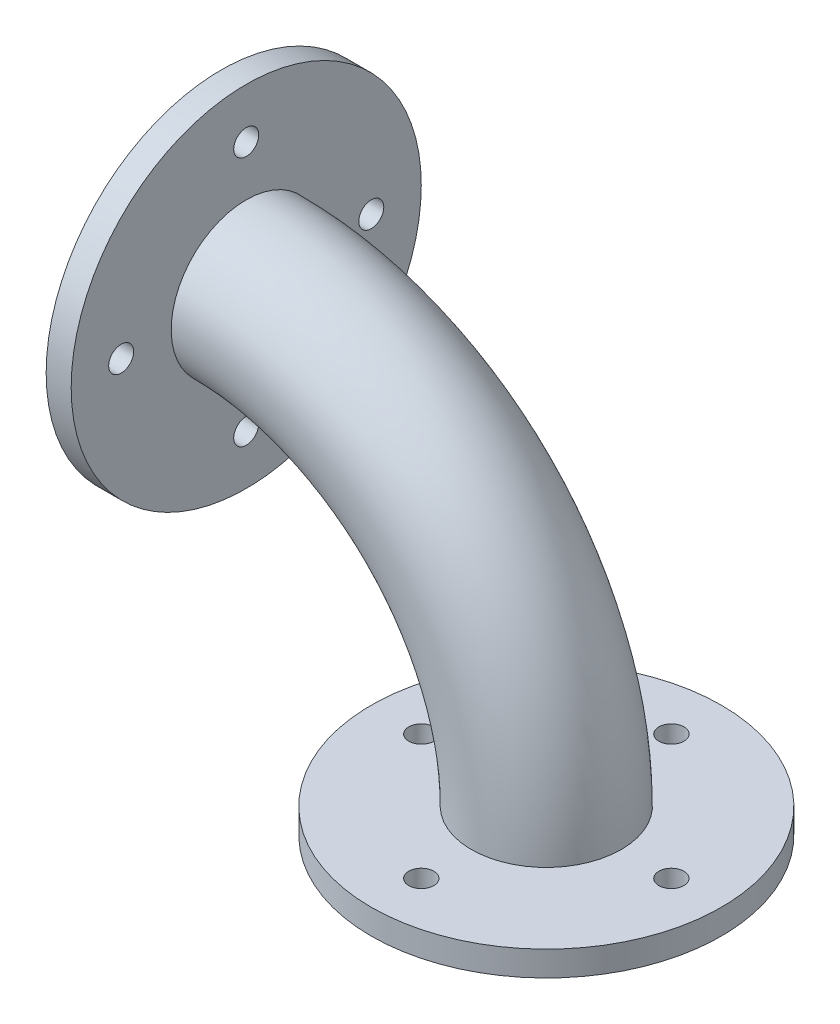
ISO-10303-21;
HEADER;
FILE_DESCRIPTION(('STEP AP214'),'2;1');
FILE_NAME('part.step','',(''),(''),'','','');
FILE_SCHEMA(('AUTOMOTIVE_DESIGN { 1 0 10303 214 1 1 1 1 }'));
ENDSEC;
DATA;
#1=APPLICATION_CONTEXT('core data for automotive mechanical design processes');
#2=APPLICATION_PROTOCOL_DEFINITION('international standard','automotive_design',2000,#1);
#3=PRODUCT_CONTEXT('',#1,'mechanical');
#4=PRODUCT('Part','Part','',(#3));
#5=PRODUCT_RELATED_PRODUCT_CATEGORY('part','',(#4));
#6=PRODUCT_DEFINITION_FORMATION('','',#4);
#7=PRODUCT_DEFINITION_CONTEXT('part definition',#1,'design');
#8=PRODUCT_DEFINITION('design','',#6,#7);
#9=PRODUCT_DEFINITION_SHAPE('','',#8);
#10=(LENGTH_UNIT() NAMED_UNIT(*) SI_UNIT(.MILLI.,.METRE.));
#11=(NAMED_UNIT(*) PLANE_ANGLE_UNIT() SI_UNIT($,.RADIAN.));
#12=(NAMED_UNIT(*) SI_UNIT($,.STERADIAN.) SOLID_ANGLE_UNIT());
#13=UNCERTAINTY_MEASURE_WITH_UNIT(LENGTH_MEASURE(1.E-05),#10,'distance_accuracy_value','');
#14=(GEOMETRIC_REPRESENTATION_CONTEXT(3) GLOBAL_UNCERTAINTY_ASSIGNED_CONTEXT((#13)) GLOBAL_UNIT_ASSIGNED_CONTEXT((#10,
#11,#12)) REPRESENTATION_CONTEXT('',''));
#15=CARTESIAN_POINT('',(0.,0.,0.));
#16=DIRECTION('',(0.,0.,1.));
#17=DIRECTION('',(1.,0.,0.));
#18=AXIS2_PLACEMENT_3D('',#15,#16,#17);
#19=CARTESIAN_POINT('',(0.,0.,0.));
#20=DIRECTION('',(0.,0.,1.));
#21=DIRECTION('',(1.,0.,0.));
#22=AXIS2_PLACEMENT_3D('',#19,#20,#21);
#23=TOROIDAL_SURFACE('',#22,76.2,19.05);
#24=CARTESIAN_POINT('',(76.2,0.,0.));
#25=DIRECTION('',(0.,-1.,0.));
#26=DIRECTION('',(0.,0.,-1.));
#27=AXIS2_PLACEMENT_3D('',#24,#25,#26);
#28=CIRCLE('',#27,19.05);
#29=CARTESIAN_POINT('',(95.25,0.,0.));
#30=VERTEX_POINT('',#29);
#31=EDGE_CURVE('E11',#30,#30,#28,.F.);
#32=CARTESIAN_POINT('',(-2.53796983429311E-13,76.2,0.));
#33=DIRECTION('',(-1.,0.,0.));
#34=DIRECTION('',(0.,-1.,0.));
#35=AXIS2_PLACEMENT_3D('',#32,#33,#34);
#36=CIRCLE('',#35,19.05);
#37=CARTESIAN_POINT('',(-3.17246229286638E-13,95.25,0.));
#38=VERTEX_POINT('',#37);
#39=EDGE_CURVE('E122',#38,#38,#36,.F.);
#40=CARTESIAN_POINT('',(0.,0.,0.));
#41=DIRECTION('',(0.,0.,1.));
#42=DIRECTION('',(1.,0.,0.));
#43=AXIS2_PLACEMENT_3D('',#40,#41,#42);
#44=CIRCLE('',#43,95.25);
#45=EDGE_CURVE('',#30,#38,#44,.T.);
#46=ORIENTED_EDGE('',*,*,#31,.T.);
#47=ORIENTED_EDGE('',*,*,#39,.T.);
#48=ORIENTED_EDGE('',*,*,#45,.T.);
#49=ORIENTED_EDGE('',*,*,#45,.F.);
#50=EDGE_LOOP('',(#46,#48,#47,#49));
#51=FACE_BOUND('',#50,.T.);
#52=ADVANCED_FACE('F80',(#51),#23,.T.);
#53=CARTESIAN_POINT('',(76.2,0.,0.));
#54=DIRECTION('',(0.,-1.,0.));
#55=DIRECTION('',(0.,0.,-1.));
#56=AXIS2_PLACEMENT_3D('',#53,#54,#55);
#57=PLANE('',#56);
#58=CARTESIAN_POINT('',(76.2,0.,31.75));
#59=DIRECTION('',(0.,-1.,0.));
#60=DIRECTION('',(0.,0.,-1.));
#61=AXIS2_PLACEMENT_3D('',#58,#59,#60);
#62=CIRCLE('',#61,3.175);
#63=CARTESIAN_POINT('',(76.2,0.,28.575));
#64=VERTEX_POINT('',#63);
#65=EDGE_CURVE('E119',#64,#64,#62,.T.);
#66=ORIENTED_EDGE('',*,*,#65,.T.);
#67=EDGE_LOOP('',(#66));
#68=FACE_BOUND('',#67,.T.);
#69=CARTESIAN_POINT('',(107.95,0.,0.));
#70=DIRECTION('',(0.,-1.,0.));
#71=DIRECTION('',(0.,0.,-1.));
#72=AXIS2_PLACEMENT_3D('',#69,#70,#71);
#73=CIRCLE('',#72,3.175);
#74=CARTESIAN_POINT('',(107.95,0.,-3.175));
#75=VERTEX_POINT('',#74);
#76=EDGE_CURVE('E113',#75,#75,#73,.T.);
#77=ORIENTED_EDGE('',*,*,#76,.T.);
#78=EDGE_LOOP('',(#77));
#79=FACE_BOUND('',#78,.T.);
#80=CARTESIAN_POINT('',(76.2,0.,-31.75));
#81=DIRECTION('',(0.,-1.,0.));
#82=DIRECTION('',(0.,0.,-1.));
#83=AXIS2_PLACEMENT_3D('',#80,#81,#82);
#84=CIRCLE('',#83,3.175);
#85=CARTESIAN_POINT('',(76.2,0.,-34.925));
#86=VERTEX_POINT('',#85);
#87=EDGE_CURVE('E107',#86,#86,#84,.T.);
#88=ORIENTED_EDGE('',*,*,#87,.T.);
#89=EDGE_LOOP('',(#88));
#90=FACE_BOUND('',#89,.T.);
#91=CARTESIAN_POINT('',(44.45,0.,0.));
#92=DIRECTION('',(0.,-1.,0.));
#93=DIRECTION('',(0.,0.,-1.));
#94=AXIS2_PLACEMENT_3D('',#91,#92,#93);
#95=CIRCLE('',#94,3.175);
#96=CARTESIAN_POINT('',(44.45,0.,-3.175));
#97=VERTEX_POINT('',#96);
#98=EDGE_CURVE('E101',#97,#97,#95,.T.);
#99=ORIENTED_EDGE('',*,*,#98,.T.);
#100=EDGE_LOOP('',(#99));
#101=FACE_BOUND('',#100,.T.);
#102=CARTESIAN_POINT('',(76.2,0.,0.));
#103=DIRECTION('',(0.,-1.,0.));
#104=DIRECTION('',(0.,0.,-1.));
#105=AXIS2_PLACEMENT_3D('',#102,#103,#104);
#106=CIRCLE('',#105,44.45);
#107=CARTESIAN_POINT('',(76.2,0.,-44.45));
#108=VERTEX_POINT('',#107);
#109=EDGE_CURVE('E95',#108,#108,#106,.T.);
#110=ORIENTED_EDGE('',*,*,#109,.F.);
#111=EDGE_LOOP('',(#110));
#112=FACE_BOUND('',#111,.T.);
#113=ORIENTED_EDGE('',*,*,#31,.F.);
#114=EDGE_LOOP('',(#113));
#115=FACE_BOUND('',#114,.T.);
#116=ADVANCED_FACE('F179',(#68,#79,#90,#101,#112,#115),#57,.F.);
#117=CARTESIAN_POINT('',(76.2,-6.35,0.));
#118=DIRECTION('',(0.,-1.,0.));
#119=DIRECTION('',(0.,0.,-1.));
#120=AXIS2_PLACEMENT_3D('',#117,#118,#119);
#121=PLANE('',#120);
#122=CARTESIAN_POINT('',(107.95,-6.35,0.));
#123=DIRECTION('',(0.,-1.,0.));
#124=DIRECTION('',(0.,0.,-1.));
#125=AXIS2_PLACEMENT_3D('',#122,#123,#124);
#126=CIRCLE('',#125,3.175);
#127=CARTESIAN_POINT('',(107.95,-6.35,-3.175));
#128=VERTEX_POINT('',#127);
#129=EDGE_CURVE('E110',#128,#128,#126,.T.);
#130=ORIENTED_EDGE('',*,*,#129,.F.);
#131=EDGE_LOOP('',(#130));
#132=FACE_BOUND('',#131,.T.);
#133=CARTESIAN_POINT('',(44.45,-6.35,0.));
#134=DIRECTION('',(0.,-1.,0.));
#135=DIRECTION('',(0.,0.,-1.));
#136=AXIS2_PLACEMENT_3D('',#133,#134,#135);
#137=CIRCLE('',#136,3.175);
#138=CARTESIAN_POINT('',(44.45,-6.35,-3.175));
#139=VERTEX_POINT('',#138);
#140=EDGE_CURVE('E98',#139,#139,#137,.T.);
#141=ORIENTED_EDGE('',*,*,#140,.F.);
#142=EDGE_LOOP('',(#141));
#143=FACE_BOUND('',#142,.T.);
#144=CARTESIAN_POINT('',(76.2,-6.35,0.));
#145=DIRECTION('',(0.,-1.,0.));
#146=DIRECTION('',(0.,0.,-1.));
#147=AXIS2_PLACEMENT_3D('',#144,#145,#146);
#148=CIRCLE('',#147,44.45);
#149=CARTESIAN_POINT('',(76.2,-6.35,-44.45));
#150=VERTEX_POINT('',#149);
#151=EDGE_CURVE('E92',#150,#150,#148,.T.);
#152=ORIENTED_EDGE('',*,*,#151,.T.);
#153=EDGE_LOOP('',(#152));
#154=FACE_BOUND('',#153,.T.);
#155=CARTESIAN_POINT('',(76.2,-6.35,-31.75));
#156=DIRECTION('',(0.,-1.,0.));
#157=DIRECTION('',(0.,0.,-1.));
#158=AXIS2_PLACEMENT_3D('',#155,#156,#157);
#159=CIRCLE('',#158,3.175);
#160=CARTESIAN_POINT('',(76.2,-6.35,-34.925));
#161=VERTEX_POINT('',#160);
#162=EDGE_CURVE('E104',#161,#161,#159,.T.);
#163=ORIENTED_EDGE('',*,*,#162,.F.);
#164=EDGE_LOOP('',(#163));
#165=FACE_BOUND('',#164,.T.);
#166=CARTESIAN_POINT('',(76.2,-6.35,31.75));
#167=DIRECTION('',(0.,-1.,0.));
#168=DIRECTION('',(0.,0.,-1.));
#169=AXIS2_PLACEMENT_3D('',#166,#167,#168);
#170=CIRCLE('',#169,3.175);
#171=CARTESIAN_POINT('',(76.2,-6.35,28.575));
#172=VERTEX_POINT('',#171);
#173=EDGE_CURVE('E116',#172,#172,#170,.T.);
#174=ORIENTED_EDGE('',*,*,#173,.F.);
#175=EDGE_LOOP('',(#174));
#176=FACE_BOUND('',#175,.T.);
#177=ADVANCED_FACE('F183',(#132,#143,#154,#165,#176),#121,.T.);
#178=CARTESIAN_POINT('',(76.2,-6.35,0.));
#179=DIRECTION('',(0.,1.,0.));
#180=DIRECTION('',(0.,0.,1.));
#181=AXIS2_PLACEMENT_3D('',#178,#179,#180);
#182=CYLINDRICAL_SURFACE('',#181,44.45);
#183=ORIENTED_EDGE('',*,*,#151,.F.);
#184=EDGE_LOOP('',(#183));
#185=FACE_BOUND('',#184,.T.);
#186=ORIENTED_EDGE('',*,*,#109,.T.);
#187=EDGE_LOOP('',(#186));
#188=FACE_BOUND('',#187,.T.);
#189=ADVANCED_FACE('F190',(#185,#188),#182,.T.);
#190=CARTESIAN_POINT('',(44.45,-6.35,0.));
#191=DIRECTION('',(0.,1.,0.));
#192=DIRECTION('',(0.,0.,1.));
#193=AXIS2_PLACEMENT_3D('',#190,#191,#192);
#194=CYLINDRICAL_SURFACE('',#193,3.175);
#195=ORIENTED_EDGE('',*,*,#140,.T.);
#196=EDGE_LOOP('',(#195));
#197=FACE_BOUND('',#196,.T.);
#198=ORIENTED_EDGE('',*,*,#98,.F.);
#199=EDGE_LOOP('',(#198));
#200=FACE_BOUND('',#199,.T.);
#201=ADVANCED_FACE('F227',(#197,#200),#194,.F.);
#202=CARTESIAN_POINT('',(76.2,-6.35,-31.75));
#203=DIRECTION('',(0.,1.,0.));
#204=DIRECTION('',(0.,0.,1.));
#205=AXIS2_PLACEMENT_3D('',#202,#203,#204);
#206=CYLINDRICAL_SURFACE('',#205,3.175);
#207=ORIENTED_EDGE('',*,*,#162,.T.);
#208=EDGE_LOOP('',(#207));
#209=FACE_BOUND('',#208,.T.);
#210=ORIENTED_EDGE('',*,*,#87,.F.);
#211=EDGE_LOOP('',(#210));
#212=FACE_BOUND('',#211,.T.);
#213=ADVANCED_FACE('F223',(#209,#212),#206,.F.);
#214=CARTESIAN_POINT('',(107.95,-6.35,0.));
#215=DIRECTION('',(0.,1.,0.));
#216=DIRECTION('',(0.,0.,1.));
#217=AXIS2_PLACEMENT_3D('',#214,#215,#216);
#218=CYLINDRICAL_SURFACE('',#217,3.175);
#219=ORIENTED_EDGE('',*,*,#129,.T.);
#220=EDGE_LOOP('',(#219));
#221=FACE_BOUND('',#220,.T.);
#222=ORIENTED_EDGE('',*,*,#76,.F.);
#223=EDGE_LOOP('',(#222));
#224=FACE_BOUND('',#223,.T.);
#225=ADVANCED_FACE('F219',(#221,#224),#218,.F.);
#226=CARTESIAN_POINT('',(76.2,-6.35,31.75));
#227=DIRECTION('',(0.,1.,0.));
#228=DIRECTION('',(0.,0.,1.));
#229=AXIS2_PLACEMENT_3D('',#226,#227,#228);
#230=CYLINDRICAL_SURFACE('',#229,3.175);
#231=ORIENTED_EDGE('',*,*,#173,.T.);
#232=EDGE_LOOP('',(#231));
#233=FACE_BOUND('',#232,.T.);
#234=ORIENTED_EDGE('',*,*,#65,.F.);
#235=EDGE_LOOP('',(#234));
#236=FACE_BOUND('',#235,.T.);
#237=ADVANCED_FACE('F172',(#233,#236),#230,.F.);
#238=CARTESIAN_POINT('',(-2.70716782324598E-13,76.2,0.));
#239=DIRECTION('',(-1.,0.,0.));
#240=DIRECTION('',(0.,0.,-1.));
#241=AXIS2_PLACEMENT_3D('',#238,#239,#240);
#242=PLANE('',#241);
#243=CARTESIAN_POINT('',(-2.70716782324598E-13,76.2,0.));
#244=DIRECTION('',(1.,0.,0.));
#245=DIRECTION('',(0.,0.,-1.));
#246=AXIS2_PLACEMENT_3D('',#243,#244,#245);
#247=CIRCLE('',#246,44.45);
#248=CARTESIAN_POINT('',(-2.70716782324598E-13,76.2,-44.45));
#249=VERTEX_POINT('',#248);
#250=EDGE_CURVE('E127',#249,#249,#247,.T.);
#251=ORIENTED_EDGE('',*,*,#250,.T.);
#252=EDGE_LOOP('',(#251));
#253=FACE_BOUND('',#252,.T.);
#254=CARTESIAN_POINT('',(-1.57918123022682E-13,44.45,0.));
#255=DIRECTION('',(1.,0.,0.));
#256=DIRECTION('',(0.,0.,-1.));
#257=AXIS2_PLACEMENT_3D('',#254,#255,#256);
#258=CIRCLE('',#257,3.175);
#259=CARTESIAN_POINT('',(-1.57918123022682E-13,44.45,-3.175));
#260=VERTEX_POINT('',#259);
#261=EDGE_CURVE('E134',#260,#260,#258,.T.);
#262=ORIENTED_EDGE('',*,*,#261,.F.);
#263=EDGE_LOOP('',(#262));
#264=FACE_BOUND('',#263,.T.);
#265=CARTESIAN_POINT('',(-2.70716782324598E-13,76.2,-31.75));
#266=DIRECTION('',(1.,0.,0.));
#267=DIRECTION('',(0.,0.,-1.));
#268=AXIS2_PLACEMENT_3D('',#265,#266,#267);
#269=CIRCLE('',#268,3.175);
#270=CARTESIAN_POINT('',(-2.70716782324598E-13,76.2,-34.925));
#271=VERTEX_POINT('',#270);
#272=EDGE_CURVE('E140',#271,#271,#269,.T.);
#273=ORIENTED_EDGE('',*,*,#272,.F.);
#274=EDGE_LOOP('',(#273));
#275=FACE_BOUND('',#274,.T.);
#276=CARTESIAN_POINT('',(-3.83515441626514E-13,107.95,0.));
#277=DIRECTION('',(1.,0.,0.));
#278=DIRECTION('',(0.,0.,-1.));
#279=AXIS2_PLACEMENT_3D('',#276,#277,#278);
#280=CIRCLE('',#279,3.175);
#281=CARTESIAN_POINT('',(-3.83515441626514E-13,107.95,-3.175));
#282=VERTEX_POINT('',#281);
#283=EDGE_CURVE('E146',#282,#282,#280,.T.);
#284=ORIENTED_EDGE('',*,*,#283,.F.);
#285=EDGE_LOOP('',(#284));
#286=FACE_BOUND('',#285,.T.);
#287=CARTESIAN_POINT('',(-2.70716782324598E-13,76.2,31.75));
#288=DIRECTION('',(1.,0.,0.));
#289=DIRECTION('',(0.,0.,-1.));
#290=AXIS2_PLACEMENT_3D('',#287,#288,#289);
#291=CIRCLE('',#290,3.175);
#292=CARTESIAN_POINT('',(-2.70716782324598E-13,76.2,28.575));
#293=VERTEX_POINT('',#292);
#294=EDGE_CURVE('E152',#293,#293,#291,.T.);
#295=ORIENTED_EDGE('',*,*,#294,.F.);
#296=EDGE_LOOP('',(#295));
#297=FACE_BOUND('',#296,.T.);
#298=ORIENTED_EDGE('',*,*,#39,.F.);
#299=EDGE_LOOP('',(#298));
#300=FACE_BOUND('',#299,.T.);
#301=ADVANCED_FACE('F168',(#253,#264,#275,#286,#297,#300),#242,.F.);
#302=CARTESIAN_POINT('',(-6.35000000000027,76.2,0.));
#303=DIRECTION('',(1.,0.,0.));
#304=DIRECTION('',(0.,1.,0.));
#305=AXIS2_PLACEMENT_3D('',#302,#303,#304);
#306=CYLINDRICAL_SURFACE('',#305,44.45);
#307=CARTESIAN_POINT('',(-6.35000000000027,76.2,0.));
#308=DIRECTION('',(1.,0.,0.));
#309=DIRECTION('',(0.,0.,-1.));
#310=AXIS2_PLACEMENT_3D('',#307,#308,#309);
#311=CIRCLE('',#310,44.45);
#312=CARTESIAN_POINT('',(-6.35000000000027,76.2,-44.45));
#313=VERTEX_POINT('',#312);
#314=EDGE_CURVE('E130',#313,#313,#311,.T.);
#315=ORIENTED_EDGE('',*,*,#314,.T.);
#316=EDGE_LOOP('',(#315));
#317=FACE_BOUND('',#316,.T.);
#318=ORIENTED_EDGE('',*,*,#250,.F.);
#319=EDGE_LOOP('',(#318));
#320=FACE_BOUND('',#319,.T.);
#321=ADVANCED_FACE('F171',(#317,#320),#306,.T.);
#322=CARTESIAN_POINT('',(-6.35000000000027,76.2,0.));
#323=DIRECTION('',(-1.,0.,0.));
#324=DIRECTION('',(0.,0.,-1.));
#325=AXIS2_PLACEMENT_3D('',#322,#323,#324);
#326=PLANE('',#325);
#327=CARTESIAN_POINT('',(-6.35000000000027,76.2,31.75));
#328=DIRECTION('',(1.,0.,0.));
#329=DIRECTION('',(0.,0.,-1.));
#330=AXIS2_PLACEMENT_3D('',#327,#328,#329);
#331=CIRCLE('',#330,3.175);
#332=CARTESIAN_POINT('',(-6.35000000000027,76.2,28.575));
#333=VERTEX_POINT('',#332);
#334=EDGE_CURVE('E149',#333,#333,#331,.T.);
#335=ORIENTED_EDGE('',*,*,#334,.T.);
#336=EDGE_LOOP('',(#335));
#337=FACE_BOUND('',#336,.T.);
#338=CARTESIAN_POINT('',(-6.35000000000038,107.95,0.));
#339=DIRECTION('',(1.,0.,0.));
#340=DIRECTION('',(0.,0.,-1.));
#341=AXIS2_PLACEMENT_3D('',#338,#339,#340);
#342=CIRCLE('',#341,3.175);
#343=CARTESIAN_POINT('',(-6.35000000000038,107.95,-3.175));
#344=VERTEX_POINT('',#343);
#345=EDGE_CURVE('E143',#344,#344,#342,.T.);
#346=ORIENTED_EDGE('',*,*,#345,.T.);
#347=EDGE_LOOP('',(#346));
#348=FACE_BOUND('',#347,.T.);
#349=CARTESIAN_POINT('',(-6.35000000000027,76.2,-31.75));
#350=DIRECTION('',(1.,0.,0.));
#351=DIRECTION('',(0.,0.,-1.));
#352=AXIS2_PLACEMENT_3D('',#349,#350,#351);
#353=CIRCLE('',#352,3.175);
#354=CARTESIAN_POINT('',(-6.35000000000027,76.2,-34.925));
#355=VERTEX_POINT('',#354);
#356=EDGE_CURVE('E137',#355,#355,#353,.T.);
#357=ORIENTED_EDGE('',*,*,#356,.T.);
#358=EDGE_LOOP('',(#357));
#359=FACE_BOUND('',#358,.T.);
#360=CARTESIAN_POINT('',(-6.35000000000016,44.45,0.));
#361=DIRECTION('',(1.,0.,0.));
#362=DIRECTION('',(0.,0.,-1.));
#363=AXIS2_PLACEMENT_3D('',#360,#361,#362);
#364=CIRCLE('',#363,3.175);
#365=CARTESIAN_POINT('',(-6.35000000000016,44.45,-3.175));
#366=VERTEX_POINT('',#365);
#367=EDGE_CURVE('E131',#366,#366,#364,.T.);
#368=ORIENTED_EDGE('',*,*,#367,.T.);
#369=EDGE_LOOP('',(#368));
#370=FACE_BOUND('',#369,.T.);
#371=ORIENTED_EDGE('',*,*,#314,.F.);
#372=EDGE_LOOP('',(#371));
#373=FACE_BOUND('',#372,.T.);
#374=ADVANCED_FACE('F158',(#337,#348,#359,#370,#373),#326,.T.);
#375=CARTESIAN_POINT('',(-6.35000000000016,44.45,0.));
#376=DIRECTION('',(1.,0.,0.));
#377=DIRECTION('',(0.,1.,0.));
#378=AXIS2_PLACEMENT_3D('',#375,#376,#377);
#379=CYLINDRICAL_SURFACE('',#378,3.175);
#380=ORIENTED_EDGE('',*,*,#367,.F.);
#381=EDGE_LOOP('',(#380));
#382=FACE_BOUND('',#381,.T.);
#383=ORIENTED_EDGE('',*,*,#261,.T.);
#384=EDGE_LOOP('',(#383));
#385=FACE_BOUND('',#384,.T.);
#386=ADVANCED_FACE('F320',(#382,#385),#379,.F.);
#387=CARTESIAN_POINT('',(-6.35000000000027,76.2,-31.75));
#388=DIRECTION('',(1.,0.,0.));
#389=DIRECTION('',(0.,1.,0.));
#390=AXIS2_PLACEMENT_3D('',#387,#388,#389);
#391=CYLINDRICAL_SURFACE('',#390,3.175);
#392=ORIENTED_EDGE('',*,*,#356,.F.);
#393=EDGE_LOOP('',(#392));
#394=FACE_BOUND('',#393,.T.);
#395=ORIENTED_EDGE('',*,*,#272,.T.);
#396=EDGE_LOOP('',(#395));
#397=FACE_BOUND('',#396,.T.);
#398=ADVANCED_FACE('F327',(#394,#397),#391,.F.);
#399=CARTESIAN_POINT('',(-6.35000000000038,107.95,0.));
#400=DIRECTION('',(1.,0.,0.));
#401=DIRECTION('',(0.,1.,0.));
#402=AXIS2_PLACEMENT_3D('',#399,#400,#401);
#403=CYLINDRICAL_SURFACE('',#402,3.175);
#404=ORIENTED_EDGE('',*,*,#345,.F.);
#405=EDGE_LOOP('',(#404));
#406=FACE_BOUND('',#405,.T.);
#407=ORIENTED_EDGE('',*,*,#283,.T.);
#408=EDGE_LOOP('',(#407));
#409=FACE_BOUND('',#408,.T.);
#410=ADVANCED_FACE('F164',(#406,#409),#403,.F.);
#411=CARTESIAN_POINT('',(-6.35000000000027,76.2,31.75));
#412=DIRECTION('',(1.,0.,0.));
#413=DIRECTION('',(0.,1.,0.));
#414=AXIS2_PLACEMENT_3D('',#411,#412,#413);
#415=CYLINDRICAL_SURFACE('',#414,3.175);
#416=ORIENTED_EDGE('',*,*,#334,.F.);
#417=EDGE_LOOP('',(#416));
#418=FACE_BOUND('',#417,.T.);
#419=ORIENTED_EDGE('',*,*,#294,.T.);
#420=EDGE_LOOP('',(#419));
#421=FACE_BOUND('',#420,.T.);
#422=ADVANCED_FACE('F161',(#418,#421),#415,.F.);
#423=CLOSED_SHELL('',(#52,#116,#177,#189,#201,#213,#225,#237,#301,#321,#374,#386,#398,#410,#422));
#424=CARTESIAN_POINT('',(76.2,0.,0.));
#425=DIRECTION('',(0.,-1.,0.));
#426=DIRECTION('',(0.,0.,-1.));
#427=AXIS2_PLACEMENT_3D('',#424,#425,#426);
#428=CIRCLE('',#427,12.7);
#429=CARTESIAN_POINT('',(88.9,0.,0.));
#430=VERTEX_POINT('',#429);
#431=EDGE_CURVE('E88',#430,#430,#428,.T.);
#432=ORIENTED_EDGE('',*,*,#431,.F.);
#433=EDGE_LOOP('',(#432));
#434=FACE_BOUND('',#433,.T.);
#435=ADVANCED_FACE('F186',(#434),#57,.F.);
#436=CARTESIAN_POINT('',(0.,0.,0.));
#437=DIRECTION('',(0.,0.,1.));
#438=DIRECTION('',(1.,0.,0.));
#439=AXIS2_PLACEMENT_3D('',#436,#437,#438);
#440=TOROIDAL_SURFACE('',#439,76.2,12.7);
#441=CARTESIAN_POINT('',(-2.53796983429311E-13,76.2,0.));
#442=DIRECTION('',(-1.,0.,0.));
#443=DIRECTION('',(0.,-1.,0.));
#444=AXIS2_PLACEMENT_3D('',#441,#442,#443);
#445=CIRCLE('',#444,12.7);
#446=CARTESIAN_POINT('',(-2.96096480667529E-13,88.9,0.));
#447=VERTEX_POINT('',#446);
#448=EDGE_CURVE('E83',#447,#447,#445,.T.);
#449=CARTESIAN_POINT('',(0.,0.,0.));
#450=DIRECTION('',(0.,0.,1.));
#451=DIRECTION('',(1.,0.,0.));
#452=AXIS2_PLACEMENT_3D('',#449,#450,#451);
#453=CIRCLE('',#452,88.9);
#454=EDGE_CURVE('',#430,#447,#453,.T.);
#455=ORIENTED_EDGE('',*,*,#431,.T.);
#456=ORIENTED_EDGE('',*,*,#448,.T.);
#457=ORIENTED_EDGE('',*,*,#454,.T.);
#458=ORIENTED_EDGE('',*,*,#454,.F.);
#459=EDGE_LOOP('',(#455,#457,#456,#458));
#460=FACE_BOUND('',#459,.T.);
#461=ADVANCED_FACE('F196',(#460),#440,.F.);
#462=ORIENTED_EDGE('',*,*,#448,.F.);
#463=EDGE_LOOP('',(#462));
#464=FACE_BOUND('',#463,.T.);
#465=ADVANCED_FACE('F175',(#464),#242,.F.);
#466=CLOSED_SHELL('',(#435,#461,#465));
#467=ORIENTED_CLOSED_SHELL('',*,#466,.T.);
#468=BREP_WITH_VOIDS('B2',#423,(#467));
#469=ADVANCED_BREP_SHAPE_REPRESENTATION('',(#18,#468),#14);
#470=SHAPE_DEFINITION_REPRESENTATION(#9,#469);
ENDSEC;
END-ISO-10303-21;
